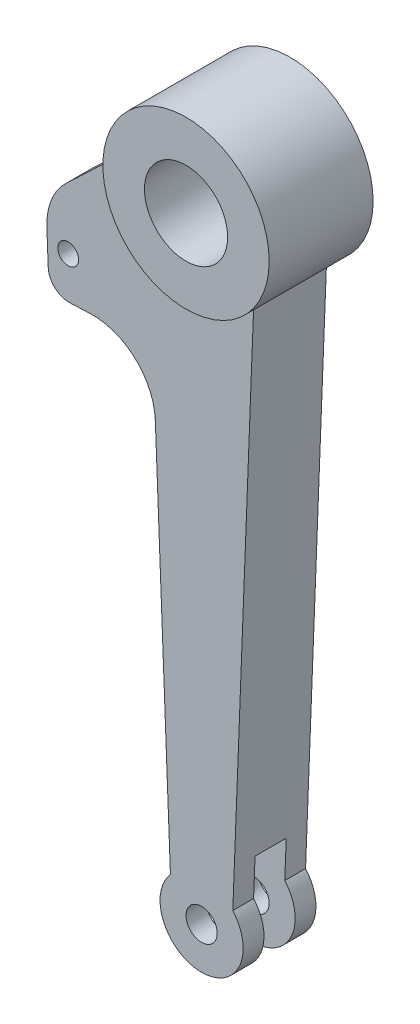
ISO-10303-21;
HEADER;
FILE_DESCRIPTION(('STEP AP214'),'2;1');
FILE_NAME('part.step','',(''),(''),'','','');
FILE_SCHEMA(('AUTOMOTIVE_DESIGN { 1 0 10303 214 1 1 1 1 }'));
ENDSEC;
DATA;
#1=APPLICATION_CONTEXT('core data for automotive mechanical design processes');
#2=APPLICATION_PROTOCOL_DEFINITION('international standard','automotive_design',2000,#1);
#3=PRODUCT_CONTEXT('',#1,'mechanical');
#4=PRODUCT('Part','Part','',(#3));
#5=PRODUCT_RELATED_PRODUCT_CATEGORY('part','',(#4));
#6=PRODUCT_DEFINITION_FORMATION('','',#4);
#7=PRODUCT_DEFINITION_CONTEXT('part definition',#1,'design');
#8=PRODUCT_DEFINITION('design','',#6,#7);
#9=PRODUCT_DEFINITION_SHAPE('','',#8);
#10=(LENGTH_UNIT() NAMED_UNIT(*) SI_UNIT(.MILLI.,.METRE.));
#11=(NAMED_UNIT(*) PLANE_ANGLE_UNIT() SI_UNIT($,.RADIAN.));
#12=(NAMED_UNIT(*) SI_UNIT($,.STERADIAN.) SOLID_ANGLE_UNIT());
#13=UNCERTAINTY_MEASURE_WITH_UNIT(LENGTH_MEASURE(1.E-05),#10,'distance_accuracy_value','');
#14=(GEOMETRIC_REPRESENTATION_CONTEXT(3) GLOBAL_UNCERTAINTY_ASSIGNED_CONTEXT((#13)) GLOBAL_UNIT_ASSIGNED_CONTEXT((#10,
#11,#12)) REPRESENTATION_CONTEXT('',''));
#15=CARTESIAN_POINT('',(0.,0.,0.));
#16=DIRECTION('',(0.,0.,1.));
#17=DIRECTION('',(1.,0.,0.));
#18=AXIS2_PLACEMENT_3D('',#15,#16,#17);
#19=CARTESIAN_POINT('',(-25.,-31.224989991992,17.5));
#20=DIRECTION('',(0.999235227011224,0.0391019321751174,0.));
#21=DIRECTION('',(-0.0391019321751174,0.999235227011224,0.));
#22=AXIS2_PLACEMENT_3D('',#19,#20,#21);
#23=PLANE('',#22);
#24=DIRECTION('',(0.0391019321751174,-0.999235227011224,0.));
#25=VECTOR('',#24,1.);
#26=CARTESIAN_POINT('',(-25.,-31.224989991992,17.5));
#27=LINE('',#26,#25);
#28=CARTESIAN_POINT('',(-22.2628647477418,-101.171455882778,17.5));
#29=VERTEX_POINT('',#28);
#30=CARTESIAN_POINT('',(-15.,-286.771243444677,17.5));
#31=VERTEX_POINT('',#30);
#32=EDGE_CURVE('E393',#29,#31,#27,.T.);
#33=ORIENTED_EDGE('',*,*,#32,.F.);
#34=DIRECTION('',(0.,0.,1.));
#35=VECTOR('',#34,1.);
#36=CARTESIAN_POINT('',(-22.2628647477418,-101.171455882778,5.));
#37=LINE('',#36,#35);
#38=CARTESIAN_POINT('',(-22.2628647477418,-101.171455882778,5.));
#39=VERTEX_POINT('',#38);
#40=EDGE_CURVE('E214',#29,#39,#37,.F.);
#41=ORIENTED_EDGE('',*,*,#40,.T.);
#42=DIRECTION('',(0.0391019321751174,-0.999235227011224,0.));
#43=VECTOR('',#42,1.);
#44=CARTESIAN_POINT('',(-26.1817996580687,-1.02454249687978,5.));
#45=LINE('',#44,#43);
#46=CARTESIAN_POINT('',(-25.,-31.224989991992,5.));
#47=VERTEX_POINT('',#46);
#48=EDGE_CURVE('E197',#47,#39,#45,.T.);
#49=ORIENTED_EDGE('',*,*,#48,.F.);
#50=DIRECTION('',(0.,0.,-1.));
#51=VECTOR('',#50,1.);
#52=CARTESIAN_POINT('',(-25.,-31.224989991992,17.5));
#53=LINE('',#52,#51);
#54=CARTESIAN_POINT('',(-25.,-31.224989991992,-5.));
#55=VERTEX_POINT('',#54);
#56=EDGE_CURVE('E211',#47,#55,#53,.T.);
#57=ORIENTED_EDGE('',*,*,#56,.T.);
#58=DIRECTION('',(0.0391019321751174,-0.999235227011224,0.));
#59=VECTOR('',#58,1.);
#60=CARTESIAN_POINT('',(-26.1817996580687,-1.02454249687978,-5.00000000000001));
#61=LINE('',#60,#59);
#62=CARTESIAN_POINT('',(-22.2628647477418,-101.171455882778,-4.99999999999999));
#63=VERTEX_POINT('',#62);
#64=EDGE_CURVE('E346',#55,#63,#61,.T.);
#65=ORIENTED_EDGE('',*,*,#64,.T.);
#66=DIRECTION('',(0.,0.,1.));
#67=VECTOR('',#66,1.);
#68=CARTESIAN_POINT('',(-22.2628647477418,-101.171455882778,-17.5));
#69=LINE('',#68,#67);
#70=CARTESIAN_POINT('',(-22.2628647477418,-101.171455882778,-17.5));
#71=VERTEX_POINT('',#70);
#72=EDGE_CURVE('E282',#63,#71,#69,.F.);
#73=ORIENTED_EDGE('',*,*,#72,.T.);
#74=DIRECTION('',(0.0391019321751174,-0.999235227011224,0.));
#75=VECTOR('',#74,1.);
#76=CARTESIAN_POINT('',(-25.,-31.224989991992,-17.5));
#77=LINE('',#76,#75);
#78=CARTESIAN_POINT('',(-15.,-286.771243444677,-17.5));
#79=VERTEX_POINT('',#78);
#80=EDGE_CURVE('E403',#71,#79,#77,.T.);
#81=ORIENTED_EDGE('',*,*,#80,.T.);
#82=DIRECTION('',(0.,0.,-1.));
#83=VECTOR('',#82,1.);
#84=CARTESIAN_POINT('',(-15.,-286.771243444677,17.5));
#85=LINE('',#84,#83);
#86=CARTESIAN_POINT('',(-15.,-286.771243444677,-7.5));
#87=VERTEX_POINT('',#86);
#88=EDGE_CURVE('E229',#87,#79,#85,.T.);
#89=ORIENTED_EDGE('',*,*,#88,.F.);
#90=DIRECTION('',(0.0391019321751174,-0.999235227011224,0.));
#91=VECTOR('',#90,1.);
#92=CARTESIAN_POINT('',(-25.,-31.224989991992,-7.5));
#93=LINE('',#92,#91);
#94=CARTESIAN_POINT('',(-15.7062997421266,-268.722018153172,-7.5));
#95=VERTEX_POINT('',#94);
#96=EDGE_CURVE('E379',#95,#87,#93,.T.);
#97=ORIENTED_EDGE('',*,*,#96,.F.);
#98=DIRECTION('',(0.,0.,1.));
#99=VECTOR('',#98,1.);
#100=CARTESIAN_POINT('',(-15.7062997421266,-268.722018153172,-7.5));
#101=LINE('',#100,#99);
#102=CARTESIAN_POINT('',(-15.7062997421266,-268.722018153172,7.5));
#103=VERTEX_POINT('',#102);
#104=EDGE_CURVE('E381',#95,#103,#101,.T.);
#105=ORIENTED_EDGE('',*,*,#104,.T.);
#106=DIRECTION('',(0.0391019321751174,-0.999235227011224,0.));
#107=VECTOR('',#106,1.);
#108=CARTESIAN_POINT('',(-25.,-31.224989991992,7.5));
#109=LINE('',#108,#107);
#110=CARTESIAN_POINT('',(-15.,-286.771243444677,7.5));
#111=VERTEX_POINT('',#110);
#112=EDGE_CURVE('E251',#103,#111,#109,.T.);
#113=ORIENTED_EDGE('',*,*,#112,.T.);
#114=EDGE_CURVE('E223',#31,#111,#85,.T.);
#115=ORIENTED_EDGE('',*,*,#114,.F.);
#116=EDGE_LOOP('',(#33,#41,#49,#57,#65,#73,#81,#89,#97,#105,#113,#115));
#117=FACE_BOUND('',#116,.T.);
#118=ADVANCED_FACE('F35',(#117),#23,.F.);
#119=CARTESIAN_POINT('',(0.,-300.,17.5));
#120=DIRECTION('',(0.,0.,-1.));
#121=DIRECTION('',(-1.,0.,0.));
#122=AXIS2_PLACEMENT_3D('',#119,#120,#121);
#123=CYLINDRICAL_SURFACE('',#122,20.);
#124=CARTESIAN_POINT('',(0.,-300.,-7.5));
#125=DIRECTION('',(0.,0.,1.));
#126=DIRECTION('',(1.,0.,0.));
#127=AXIS2_PLACEMENT_3D('',#124,#125,#126);
#128=CIRCLE('',#127,20.);
#129=CARTESIAN_POINT('',(15.,-286.771243444677,-7.5));
#130=VERTEX_POINT('',#129);
#131=EDGE_CURVE('E377',#87,#130,#128,.T.);
#132=ORIENTED_EDGE('',*,*,#131,.F.);
#133=ORIENTED_EDGE('',*,*,#88,.T.);
#134=CARTESIAN_POINT('',(0.,-300.,-17.5));
#135=DIRECTION('',(0.,0.,1.));
#136=DIRECTION('',(1.,0.,0.));
#137=AXIS2_PLACEMENT_3D('',#134,#135,#136);
#138=CIRCLE('',#137,20.);
#139=CARTESIAN_POINT('',(15.,-286.771243444677,-17.5));
#140=VERTEX_POINT('',#139);
#141=EDGE_CURVE('E405',#79,#140,#138,.T.);
#142=ORIENTED_EDGE('',*,*,#141,.T.);
#143=DIRECTION('',(0.,0.,-1.));
#144=VECTOR('',#143,1.);
#145=CARTESIAN_POINT('',(15.,-286.771243444677,17.5));
#146=LINE('',#145,#144);
#147=EDGE_CURVE('E410',#130,#140,#146,.T.);
#148=ORIENTED_EDGE('',*,*,#147,.F.);
#149=EDGE_LOOP('',(#132,#133,#142,#148));
#150=FACE_BOUND('',#149,.T.);
#151=ADVANCED_FACE('F426',(#150),#123,.T.);
#152=CARTESIAN_POINT('',(15.,-286.771243444677,17.5));
#153=DIRECTION('',(-0.999235227011224,0.0391019321751174,0.));
#154=DIRECTION('',(-0.0391019321751174,-0.999235227011224,0.));
#155=AXIS2_PLACEMENT_3D('',#152,#153,#154);
#156=PLANE('',#155);
#157=DIRECTION('',(0.0391019321751174,0.999235227011224,0.));
#158=VECTOR('',#157,1.);
#159=CARTESIAN_POINT('',(15.,-286.771243444677,-7.5));
#160=LINE('',#159,#158);
#161=CARTESIAN_POINT('',(15.7062997421266,-268.722018153172,-7.5));
#162=VERTEX_POINT('',#161);
#163=EDGE_CURVE('E250',#130,#162,#160,.T.);
#164=ORIENTED_EDGE('',*,*,#163,.F.);
#165=ORIENTED_EDGE('',*,*,#147,.T.);
#166=DIRECTION('',(0.0391019321751174,0.999235227011224,0.));
#167=VECTOR('',#166,1.);
#168=CARTESIAN_POINT('',(15.,-286.771243444677,-17.5));
#169=LINE('',#168,#167);
#170=CARTESIAN_POINT('',(25.,-31.224989991992,-17.5));
#171=VERTEX_POINT('',#170);
#172=EDGE_CURVE('E394',#140,#171,#169,.T.);
#173=ORIENTED_EDGE('',*,*,#172,.T.);
#174=DIRECTION('',(0.,0.,-1.));
#175=VECTOR('',#174,1.);
#176=CARTESIAN_POINT('',(25.,-31.224989991992,17.5));
#177=LINE('',#176,#175);
#178=CARTESIAN_POINT('',(25.,-31.224989991992,17.5));
#179=VERTEX_POINT('',#178);
#180=EDGE_CURVE('E401',#179,#171,#177,.T.);
#181=ORIENTED_EDGE('',*,*,#180,.F.);
#182=DIRECTION('',(0.0391019321751174,0.999235227011224,0.));
#183=VECTOR('',#182,1.);
#184=CARTESIAN_POINT('',(15.,-286.771243444677,17.5));
#185=LINE('',#184,#183);
#186=CARTESIAN_POINT('',(15.,-286.771243444677,17.5));
#187=VERTEX_POINT('',#186);
#188=EDGE_CURVE('E398',#187,#179,#185,.T.);
#189=ORIENTED_EDGE('',*,*,#188,.F.);
#190=CARTESIAN_POINT('',(15.,-286.771243444677,7.5));
#191=VERTEX_POINT('',#190);
#192=EDGE_CURVE('E411',#187,#191,#146,.T.);
#193=ORIENTED_EDGE('',*,*,#192,.T.);
#194=DIRECTION('',(0.0391019321751174,0.999235227011224,0.));
#195=VECTOR('',#194,1.);
#196=CARTESIAN_POINT('',(15.,-286.771243444677,7.5));
#197=LINE('',#196,#195);
#198=CARTESIAN_POINT('',(15.7062997421266,-268.722018153172,7.5));
#199=VERTEX_POINT('',#198);
#200=EDGE_CURVE('E245',#191,#199,#197,.T.);
#201=ORIENTED_EDGE('',*,*,#200,.T.);
#202=DIRECTION('',(0.,0.,1.));
#203=VECTOR('',#202,1.);
#204=CARTESIAN_POINT('',(15.7062997421266,-268.722018153172,-7.5));
#205=LINE('',#204,#203);
#206=EDGE_CURVE('E239',#199,#162,#205,.F.);
#207=ORIENTED_EDGE('',*,*,#206,.T.);
#208=EDGE_LOOP('',(#164,#165,#173,#181,#189,#193,#201,#207));
#209=FACE_BOUND('',#208,.T.);
#210=ADVANCED_FACE('F419',(#209),#156,.F.);
#211=CARTESIAN_POINT('',(0.,-300.,17.5));
#212=DIRECTION('',(0.,0.,-1.));
#213=DIRECTION('',(-1.,0.,0.));
#214=AXIS2_PLACEMENT_3D('',#211,#212,#213);
#215=CYLINDRICAL_SURFACE('',#214,7.50000000000001);
#216=CARTESIAN_POINT('',(0.,-300.,-17.5));
#217=DIRECTION('',(0.,0.,1.));
#218=DIRECTION('',(1.,0.,0.));
#219=AXIS2_PLACEMENT_3D('',#216,#217,#218);
#220=CIRCLE('',#219,7.50000000000001);
#221=CARTESIAN_POINT('',(7.50000000000001,-300.,-17.5));
#222=VERTEX_POINT('',#221);
#223=EDGE_CURVE('E384',#222,#222,#220,.T.);
#224=ORIENTED_EDGE('',*,*,#223,.F.);
#225=EDGE_LOOP('',(#224));
#226=FACE_BOUND('',#225,.T.);
#227=CARTESIAN_POINT('',(0.,-300.,-7.5));
#228=DIRECTION('',(0.,0.,1.));
#229=DIRECTION('',(1.,0.,0.));
#230=AXIS2_PLACEMENT_3D('',#227,#228,#229);
#231=CIRCLE('',#230,7.50000000000001);
#232=CARTESIAN_POINT('',(7.50000000000001,-300.,-7.5));
#233=VERTEX_POINT('',#232);
#234=EDGE_CURVE('E247',#233,#233,#231,.T.);
#235=ORIENTED_EDGE('',*,*,#234,.T.);
#236=EDGE_LOOP('',(#235));
#237=FACE_BOUND('',#236,.T.);
#238=ADVANCED_FACE('F499',(#226,#237),#215,.F.);
#239=CARTESIAN_POINT('',(0.,0.,25.));
#240=DIRECTION('',(0.,0.,-1.));
#241=DIRECTION('',(-1.,0.,0.));
#242=AXIS2_PLACEMENT_3D('',#239,#240,#241);
#243=CYLINDRICAL_SURFACE('',#242,40.);
#244=CARTESIAN_POINT('',(0.,0.,-25.));
#245=DIRECTION('',(0.,0.,1.));
#246=DIRECTION('',(1.,0.,0.));
#247=AXIS2_PLACEMENT_3D('',#244,#245,#246);
#248=CIRCLE('',#247,40.);
#249=CARTESIAN_POINT('',(40.,0.,-25.));
#250=VERTEX_POINT('',#249);
#251=EDGE_CURVE('E234',#250,#250,#248,.T.);
#252=ORIENTED_EDGE('',*,*,#251,.T.);
#253=EDGE_LOOP('',(#252));
#254=FACE_BOUND('',#253,.T.);
#255=CARTESIAN_POINT('',(0.,0.,25.));
#256=DIRECTION('',(0.,0.,1.));
#257=DIRECTION('',(1.,0.,0.));
#258=AXIS2_PLACEMENT_3D('',#255,#256,#257);
#259=CIRCLE('',#258,40.);
#260=CARTESIAN_POINT('',(40.,0.,25.));
#261=VERTEX_POINT('',#260);
#262=EDGE_CURVE('E236',#261,#261,#259,.T.);
#263=ORIENTED_EDGE('',*,*,#262,.F.);
#264=EDGE_LOOP('',(#263));
#265=FACE_BOUND('',#264,.T.);
#266=DIRECTION('',(0.,0.,-1.));
#267=VECTOR('',#266,1.);
#268=CARTESIAN_POINT('',(-39.8385645997927,3.59009340103295,25.));
#269=LINE('',#268,#267);
#270=CARTESIAN_POINT('',(-39.8385645997927,3.59009340103295,5.));
#271=VERTEX_POINT('',#270);
#272=CARTESIAN_POINT('',(-39.8385645997927,3.59009340103295,17.5));
#273=VERTEX_POINT('',#272);
#274=EDGE_CURVE('E299',#271,#273,#269,.F.);
#275=ORIENTED_EDGE('',*,*,#274,.T.);
#276=CARTESIAN_POINT('',(0.,0.,17.5));
#277=DIRECTION('',(0.,0.,-1.));
#278=DIRECTION('',(1.,0.,0.));
#279=AXIS2_PLACEMENT_3D('',#276,#277,#278);
#280=CIRCLE('',#279,40.);
#281=EDGE_CURVE('E391',#179,#273,#280,.T.);
#282=ORIENTED_EDGE('',*,*,#281,.F.);
#283=ORIENTED_EDGE('',*,*,#180,.T.);
#284=CARTESIAN_POINT('',(0.,0.,-17.5));
#285=DIRECTION('',(0.,0.,-1.));
#286=DIRECTION('',(1.,0.,0.));
#287=AXIS2_PLACEMENT_3D('',#284,#285,#286);
#288=CIRCLE('',#287,40.);
#289=CARTESIAN_POINT('',(-39.8385645997927,3.59009340103295,-17.5));
#290=VERTEX_POINT('',#289);
#291=EDGE_CURVE('E388',#171,#290,#288,.T.);
#292=ORIENTED_EDGE('',*,*,#291,.T.);
#293=DIRECTION('',(0.,0.,-1.));
#294=VECTOR('',#293,1.);
#295=CARTESIAN_POINT('',(-39.8385645997927,3.59009340103295,25.));
#296=LINE('',#295,#294);
#297=CARTESIAN_POINT('',(-39.8385645997927,3.59009340103295,-5.));
#298=VERTEX_POINT('',#297);
#299=EDGE_CURVE('E297',#290,#298,#296,.F.);
#300=ORIENTED_EDGE('',*,*,#299,.T.);
#301=CARTESIAN_POINT('',(0.,0.,-5.));
#302=DIRECTION('',(0.,0.,1.));
#303=DIRECTION('',(1.,0.,0.));
#304=AXIS2_PLACEMENT_3D('',#301,#302,#303);
#305=CIRCLE('',#304,40.);
#306=EDGE_CURVE('E221',#298,#55,#305,.T.);
#307=ORIENTED_EDGE('',*,*,#306,.T.);
#308=ORIENTED_EDGE('',*,*,#56,.F.);
#309=CARTESIAN_POINT('',(0.,0.,5.));
#310=DIRECTION('',(0.,0.,1.));
#311=DIRECTION('',(1.,0.,0.));
#312=AXIS2_PLACEMENT_3D('',#309,#310,#311);
#313=CIRCLE('',#312,40.);
#314=EDGE_CURVE('E193',#271,#47,#313,.T.);
#315=ORIENTED_EDGE('',*,*,#314,.F.);
#316=EDGE_LOOP('',(#275,#282,#283,#292,#300,#307,#308,#315));
#317=FACE_BOUND('',#316,.T.);
#318=ADVANCED_FACE('F219',(#254,#265,#317),#243,.T.);
#319=CARTESIAN_POINT('',(0.,0.,25.));
#320=DIRECTION('',(0.,0.,1.));
#321=DIRECTION('',(1.,0.,0.));
#322=AXIS2_PLACEMENT_3D('',#319,#320,#321);
#323=PLANE('',#322);
#324=ORIENTED_EDGE('',*,*,#262,.T.);
#325=EDGE_LOOP('',(#324));
#326=FACE_BOUND('',#325,.T.);
#327=CARTESIAN_POINT('',(0.,0.,25.));
#328=DIRECTION('',(0.,0.,1.));
#329=DIRECTION('',(1.,0.,0.));
#330=AXIS2_PLACEMENT_3D('',#327,#328,#329);
#331=CIRCLE('',#330,20.);
#332=CARTESIAN_POINT('',(20.,0.,25.));
#333=VERTEX_POINT('',#332);
#334=EDGE_CURVE('E226',#333,#333,#331,.T.);
#335=ORIENTED_EDGE('',*,*,#334,.F.);
#336=EDGE_LOOP('',(#335));
#337=FACE_BOUND('',#336,.T.);
#338=ADVANCED_FACE('F492',(#326,#337),#323,.T.);
#339=CARTESIAN_POINT('',(0.,0.,-25.));
#340=DIRECTION('',(0.,0.,1.));
#341=DIRECTION('',(1.,0.,0.));
#342=AXIS2_PLACEMENT_3D('',#339,#340,#341);
#343=PLANE('',#342);
#344=ORIENTED_EDGE('',*,*,#251,.F.);
#345=EDGE_LOOP('',(#344));
#346=FACE_BOUND('',#345,.T.);
#347=CARTESIAN_POINT('',(0.,0.,-25.));
#348=DIRECTION('',(0.,0.,1.));
#349=DIRECTION('',(1.,0.,0.));
#350=AXIS2_PLACEMENT_3D('',#347,#348,#349);
#351=CIRCLE('',#350,20.);
#352=CARTESIAN_POINT('',(20.,0.,-25.));
#353=VERTEX_POINT('',#352);
#354=EDGE_CURVE('E222',#353,#353,#351,.T.);
#355=ORIENTED_EDGE('',*,*,#354,.T.);
#356=EDGE_LOOP('',(#355));
#357=FACE_BOUND('',#356,.T.);
#358=ADVANCED_FACE('F490',(#346,#357),#343,.F.);
#359=CARTESIAN_POINT('',(0.,0.,25.));
#360=DIRECTION('',(0.,0.,-1.));
#361=DIRECTION('',(-1.,0.,0.));
#362=AXIS2_PLACEMENT_3D('',#359,#360,#361);
#363=CYLINDRICAL_SURFACE('',#362,20.);
#364=ORIENTED_EDGE('',*,*,#334,.T.);
#365=EDGE_LOOP('',(#364));
#366=FACE_BOUND('',#365,.T.);
#367=ORIENTED_EDGE('',*,*,#354,.F.);
#368=EDGE_LOOP('',(#367));
#369=FACE_BOUND('',#368,.T.);
#370=ADVANCED_FACE('F487',(#366,#369),#363,.F.);
#371=CARTESIAN_POINT('',(0.,0.,17.5));
#372=DIRECTION('',(0.,0.,1.));
#373=DIRECTION('',(1.,0.,0.));
#374=AXIS2_PLACEMENT_3D('',#371,#372,#373);
#375=PLANE('',#374);
#376=CARTESIAN_POINT('',(-64.1873704369466,-52.7737718192212,17.5));
#377=DIRECTION('',(0.,0.,1.));
#378=DIRECTION('',(1.,0.,0.));
#379=AXIS2_PLACEMENT_3D('',#376,#377,#378);
#380=CIRCLE('',#379,4.99999999999999);
#381=CARTESIAN_POINT('',(-59.1873704369467,-52.7737718192212,17.5));
#382=VERTEX_POINT('',#381);
#383=EDGE_CURVE('E350',#382,#382,#380,.T.);
#384=ORIENTED_EDGE('',*,*,#383,.F.);
#385=EDGE_LOOP('',(#384));
#386=FACE_BOUND('',#385,.T.);
#387=DIRECTION('',(0.725347292595793,0.688383109266892,0.));
#388=VECTOR('',#387,1.);
#389=CARTESIAN_POINT('',(-74.9617613505612,-33.1800866007479,17.5));
#390=LINE('',#389,#388);
#391=CARTESIAN_POINT('',(-65.1048316717084,-23.8254726531709,17.5));
#392=VERTEX_POINT('',#391);
#393=CARTESIAN_POINT('',(-42.914374657072,-2.76585617466675,17.5));
#394=VERTEX_POINT('',#393);
#395=EDGE_CURVE('E206',#392,#394,#390,.T.);
#396=ORIENTED_EDGE('',*,*,#395,.F.);
#397=CARTESIAN_POINT('',(-44.4533383937017,-45.5858914310446,17.5));
#398=DIRECTION('',(0.,0.,1.));
#399=DIRECTION('',(1.,0.,0.));
#400=AXIS2_PLACEMENT_3D('',#397,#398,#399);
#401=CIRCLE('',#400,30.);
#402=CARTESIAN_POINT('',(-74.4303952040384,-46.7589493962982,17.5));
#403=VERTEX_POINT('',#402);
#404=EDGE_CURVE('E324',#392,#403,#401,.T.);
#405=ORIENTED_EDGE('',*,*,#404,.T.);
#406=DIRECTION('',(-0.0391019321751174,0.999235227011224,0.));
#407=VECTOR('',#406,1.);
#408=CARTESIAN_POINT('',(-76.1435610086299,-2.97963910563565,17.5));
#409=LINE('',#408,#407);
#410=CARTESIAN_POINT('',(-73.7887033853077,-63.1571434110846,17.5));
#411=VERTEX_POINT('',#410);
#412=EDGE_CURVE('E355',#411,#403,#409,.T.);
#413=ORIENTED_EDGE('',*,*,#412,.F.);
#414=CARTESIAN_POINT('',(-63.7963511151954,-62.7661240893334,17.5));
#415=DIRECTION('',(0.,0.,1.));
#416=DIRECTION('',(1.,0.,0.));
#417=AXIS2_PLACEMENT_3D('',#414,#415,#416);
#418=CIRCLE('',#417,10.);
#419=CARTESIAN_POINT('',(-63.4053317934443,-72.7584763594457,17.5));
#420=VERTEX_POINT('',#419);
#421=EDGE_CURVE('E272',#411,#420,#418,.T.);
#422=ORIENTED_EDGE('',*,*,#421,.T.);
#423=DIRECTION('',(0.999235227011224,0.0391019321751174,0.));
#424=VECTOR('',#423,1.);
#425=CARTESIAN_POINT('',(-73.3976840635565,-73.1494956811968,17.5));
#426=LINE('',#425,#424);
#427=CARTESIAN_POINT('',(-53.412979523332,-72.3674570376945,17.5));
#428=VERTEX_POINT('',#427);
#429=EDGE_CURVE('E357',#420,#428,#426,.T.);
#430=ORIENTED_EDGE('',*,*,#429,.T.);
#431=CARTESIAN_POINT('',(-52.2399215580785,-102.344513848031,17.5));
#432=DIRECTION('',(0.,0.,1.));
#433=DIRECTION('',(1.,0.,0.));
#434=AXIS2_PLACEMENT_3D('',#431,#432,#433);
#435=CIRCLE('',#434,30.);
#436=EDGE_CURVE('E288',#428,#29,#435,.F.);
#437=ORIENTED_EDGE('',*,*,#436,.T.);
#438=ORIENTED_EDGE('',*,*,#32,.T.);
#439=CARTESIAN_POINT('',(0.,-300.,17.5));
#440=DIRECTION('',(0.,0.,1.));
#441=DIRECTION('',(1.,0.,0.));
#442=AXIS2_PLACEMENT_3D('',#439,#440,#441);
#443=CIRCLE('',#442,20.);
#444=EDGE_CURVE('E396',#31,#187,#443,.T.);
#445=ORIENTED_EDGE('',*,*,#444,.T.);
#446=ORIENTED_EDGE('',*,*,#188,.T.);
#447=ORIENTED_EDGE('',*,*,#281,.T.);
#448=CARTESIAN_POINT('',(-49.7982057497409,4.48761675129118,17.5));
#449=DIRECTION('',(0.,0.,1.));
#450=DIRECTION('',(1.,0.,0.));
#451=AXIS2_PLACEMENT_3D('',#448,#449,#450);
#452=CIRCLE('',#451,10.);
#453=EDGE_CURVE('E307',#273,#394,#452,.F.);
#454=ORIENTED_EDGE('',*,*,#453,.T.);
#455=EDGE_LOOP('',(#396,#405,#413,#422,#430,#437,#438,#445,#446,#447,#454));
#456=FACE_BOUND('',#455,.T.);
#457=CARTESIAN_POINT('',(0.,-300.,17.5));
#458=DIRECTION('',(0.,0.,1.));
#459=DIRECTION('',(1.,0.,0.));
#460=AXIS2_PLACEMENT_3D('',#457,#458,#459);
#461=CIRCLE('',#460,7.50000000000001);
#462=CARTESIAN_POINT('',(7.50000000000001,-300.,17.5));
#463=VERTEX_POINT('',#462);
#464=EDGE_CURVE('E385',#463,#463,#461,.T.);
#465=ORIENTED_EDGE('',*,*,#464,.F.);
#466=EDGE_LOOP('',(#465));
#467=FACE_BOUND('',#466,.T.);
#468=ADVANCED_FACE('F434',(#386,#456,#467),#375,.T.);
#469=CARTESIAN_POINT('',(0.,0.,-17.5));
#470=DIRECTION('',(0.,0.,1.));
#471=DIRECTION('',(1.,0.,0.));
#472=AXIS2_PLACEMENT_3D('',#469,#470,#471);
#473=PLANE('',#472);
#474=CARTESIAN_POINT('',(-64.1873704369466,-52.7737718192212,-17.5));
#475=DIRECTION('',(0.,0.,-1.));
#476=DIRECTION('',(-1.,0.,0.));
#477=AXIS2_PLACEMENT_3D('',#474,#475,#476);
#478=CIRCLE('',#477,4.99999999999999);
#479=CARTESIAN_POINT('',(-69.1873704369466,-52.7737718192212,-17.5));
#480=VERTEX_POINT('',#479);
#481=EDGE_CURVE('E259',#480,#480,#478,.T.);
#482=ORIENTED_EDGE('',*,*,#481,.F.);
#483=EDGE_LOOP('',(#482));
#484=FACE_BOUND('',#483,.T.);
#485=DIRECTION('',(0.0391019321751174,-0.999235227011224,0.));
#486=VECTOR('',#485,1.);
#487=CARTESIAN_POINT('',(-76.1435610086299,-2.97963910563565,-17.5));
#488=LINE('',#487,#486);
#489=CARTESIAN_POINT('',(-74.4303952040384,-46.7589493962982,-17.5));
#490=VERTEX_POINT('',#489);
#491=CARTESIAN_POINT('',(-73.7887033853077,-63.1571434110846,-17.5));
#492=VERTEX_POINT('',#491);
#493=EDGE_CURVE('E333',#490,#492,#488,.T.);
#494=ORIENTED_EDGE('',*,*,#493,.F.);
#495=CARTESIAN_POINT('',(-44.4533383937017,-45.5858914310446,-17.5));
#496=DIRECTION('',(0.,0.,1.));
#497=DIRECTION('',(1.,0.,0.));
#498=AXIS2_PLACEMENT_3D('',#495,#496,#497);
#499=CIRCLE('',#498,30.);
#500=CARTESIAN_POINT('',(-65.1048316717084,-23.8254726531709,-17.5));
#501=VERTEX_POINT('',#500);
#502=EDGE_CURVE('E57',#490,#501,#499,.F.);
#503=ORIENTED_EDGE('',*,*,#502,.T.);
#504=DIRECTION('',(0.725347292595793,0.688383109266892,0.));
#505=VECTOR('',#504,1.);
#506=CARTESIAN_POINT('',(-74.9617613505612,-33.1800866007479,-17.5));
#507=LINE('',#506,#505);
#508=CARTESIAN_POINT('',(-42.914374657072,-2.76585617466675,-17.5));
#509=VERTEX_POINT('',#508);
#510=EDGE_CURVE('E546',#501,#509,#507,.T.);
#511=ORIENTED_EDGE('',*,*,#510,.T.);
#512=CARTESIAN_POINT('',(-49.7982057497409,4.48761675129118,-17.5));
#513=DIRECTION('',(0.,0.,1.));
#514=DIRECTION('',(1.,0.,0.));
#515=AXIS2_PLACEMENT_3D('',#512,#513,#514);
#516=CIRCLE('',#515,10.);
#517=EDGE_CURVE('E311',#509,#290,#516,.T.);
#518=ORIENTED_EDGE('',*,*,#517,.T.);
#519=ORIENTED_EDGE('',*,*,#291,.F.);
#520=ORIENTED_EDGE('',*,*,#172,.F.);
#521=ORIENTED_EDGE('',*,*,#141,.F.);
#522=ORIENTED_EDGE('',*,*,#80,.F.);
#523=CARTESIAN_POINT('',(-52.2399215580785,-102.344513848031,-17.5));
#524=DIRECTION('',(0.,0.,1.));
#525=DIRECTION('',(1.,0.,0.));
#526=AXIS2_PLACEMENT_3D('',#523,#524,#525);
#527=CIRCLE('',#526,30.);
#528=CARTESIAN_POINT('',(-53.412979523332,-72.3674570376945,-17.5));
#529=VERTEX_POINT('',#528);
#530=EDGE_CURVE('E295',#71,#529,#527,.T.);
#531=ORIENTED_EDGE('',*,*,#530,.T.);
#532=DIRECTION('',(0.999235227011224,0.0391019321751174,0.));
#533=VECTOR('',#532,1.);
#534=CARTESIAN_POINT('',(-73.3976840635565,-73.1494956811968,-17.5));
#535=LINE('',#534,#533);
#536=CARTESIAN_POINT('',(-63.4053317934443,-72.7584763594457,-17.5));
#537=VERTEX_POINT('',#536);
#538=EDGE_CURVE('E217',#537,#529,#535,.T.);
#539=ORIENTED_EDGE('',*,*,#538,.F.);
#540=CARTESIAN_POINT('',(-63.7963511151954,-62.7661240893334,-17.5));
#541=DIRECTION('',(0.,0.,1.));
#542=DIRECTION('',(1.,0.,0.));
#543=AXIS2_PLACEMENT_3D('',#540,#541,#542);
#544=CIRCLE('',#543,10.);
#545=EDGE_CURVE('E266',#537,#492,#544,.F.);
#546=ORIENTED_EDGE('',*,*,#545,.T.);
#547=EDGE_LOOP('',(#494,#503,#511,#518,#519,#520,#521,#522,#531,#539,#546));
#548=FACE_BOUND('',#547,.T.);
#549=ORIENTED_EDGE('',*,*,#223,.T.);
#550=EDGE_LOOP('',(#549));
#551=FACE_BOUND('',#550,.T.);
#552=ADVANCED_FACE('F337',(#484,#548,#551),#473,.F.);
#553=ORIENTED_EDGE('',*,*,#114,.T.);
#554=CARTESIAN_POINT('',(0.,-300.,7.5));
#555=DIRECTION('',(0.,0.,1.));
#556=DIRECTION('',(1.,0.,0.));
#557=AXIS2_PLACEMENT_3D('',#554,#555,#556);
#558=CIRCLE('',#557,20.);
#559=EDGE_CURVE('E371',#111,#191,#558,.T.);
#560=ORIENTED_EDGE('',*,*,#559,.T.);
#561=ORIENTED_EDGE('',*,*,#192,.F.);
#562=ORIENTED_EDGE('',*,*,#444,.F.);
#563=EDGE_LOOP('',(#553,#560,#561,#562));
#564=FACE_BOUND('',#563,.T.);
#565=ADVANCED_FACE('F440',(#564),#123,.T.);
#566=CARTESIAN_POINT('',(0.,-300.,7.5));
#567=DIRECTION('',(0.,0.,1.));
#568=DIRECTION('',(1.,0.,0.));
#569=AXIS2_PLACEMENT_3D('',#566,#567,#568);
#570=CIRCLE('',#569,7.50000000000001);
#571=CARTESIAN_POINT('',(7.50000000000001,-300.,7.5));
#572=VERTEX_POINT('',#571);
#573=EDGE_CURVE('E242',#572,#572,#570,.T.);
#574=ORIENTED_EDGE('',*,*,#573,.F.);
#575=EDGE_LOOP('',(#574));
#576=FACE_BOUND('',#575,.T.);
#577=ORIENTED_EDGE('',*,*,#464,.T.);
#578=EDGE_LOOP('',(#577));
#579=FACE_BOUND('',#578,.T.);
#580=ADVANCED_FACE('F506',(#576,#579),#215,.F.);
#581=CARTESIAN_POINT('',(0.,-300.,-7.5));
#582=DIRECTION('',(0.,0.,1.));
#583=DIRECTION('',(1.,0.,0.));
#584=AXIS2_PLACEMENT_3D('',#581,#582,#583);
#585=CYLINDRICAL_SURFACE('',#584,35.);
#586=CARTESIAN_POINT('',(0.,-300.,-7.5));
#587=DIRECTION('',(0.,0.,1.));
#588=DIRECTION('',(1.,0.,0.));
#589=AXIS2_PLACEMENT_3D('',#586,#587,#588);
#590=CIRCLE('',#589,35.);
#591=EDGE_CURVE('E246',#162,#95,#590,.T.);
#592=ORIENTED_EDGE('',*,*,#591,.F.);
#593=ORIENTED_EDGE('',*,*,#206,.F.);
#594=CARTESIAN_POINT('',(0.,-300.,7.5));
#595=DIRECTION('',(0.,0.,1.));
#596=DIRECTION('',(1.,0.,0.));
#597=AXIS2_PLACEMENT_3D('',#594,#595,#596);
#598=CIRCLE('',#597,35.);
#599=EDGE_CURVE('E364',#199,#103,#598,.T.);
#600=ORIENTED_EDGE('',*,*,#599,.T.);
#601=ORIENTED_EDGE('',*,*,#104,.F.);
#602=EDGE_LOOP('',(#592,#593,#600,#601));
#603=FACE_BOUND('',#602,.T.);
#604=ADVANCED_FACE('F446',(#603),#585,.F.);
#605=CARTESIAN_POINT('',(0.,-300.,-7.5));
#606=DIRECTION('',(0.,0.,1.));
#607=DIRECTION('',(1.,0.,0.));
#608=AXIS2_PLACEMENT_3D('',#605,#606,#607);
#609=PLANE('',#608);
#610=ORIENTED_EDGE('',*,*,#234,.F.);
#611=EDGE_LOOP('',(#610));
#612=FACE_BOUND('',#611,.T.);
#613=ORIENTED_EDGE('',*,*,#96,.T.);
#614=ORIENTED_EDGE('',*,*,#131,.T.);
#615=ORIENTED_EDGE('',*,*,#163,.T.);
#616=ORIENTED_EDGE('',*,*,#591,.T.);
#617=EDGE_LOOP('',(#613,#614,#615,#616));
#618=FACE_BOUND('',#617,.T.);
#619=ADVANCED_FACE('F449',(#612,#618),#609,.T.);
#620=CARTESIAN_POINT('',(0.,-300.,7.5));
#621=DIRECTION('',(0.,0.,1.));
#622=DIRECTION('',(1.,0.,0.));
#623=AXIS2_PLACEMENT_3D('',#620,#621,#622);
#624=PLANE('',#623);
#625=ORIENTED_EDGE('',*,*,#573,.T.);
#626=EDGE_LOOP('',(#625));
#627=FACE_BOUND('',#626,.T.);
#628=ORIENTED_EDGE('',*,*,#599,.F.);
#629=ORIENTED_EDGE('',*,*,#200,.F.);
#630=ORIENTED_EDGE('',*,*,#559,.F.);
#631=ORIENTED_EDGE('',*,*,#112,.F.);
#632=EDGE_LOOP('',(#628,#629,#630,#631));
#633=FACE_BOUND('',#632,.T.);
#634=ADVANCED_FACE('F442',(#627,#633),#624,.F.);
#635=CARTESIAN_POINT('',(-76.1435610086299,-2.97963910563565,5.));
#636=DIRECTION('',(0.,0.,1.));
#637=DIRECTION('',(0.,-1.,0.));
#638=AXIS2_PLACEMENT_3D('',#635,#636,#637);
#639=PLANE('',#638);
#640=CARTESIAN_POINT('',(-64.1873704369466,-52.7737718192212,5.));
#641=DIRECTION('',(0.,0.,1.));
#642=DIRECTION('',(0.,-1.,0.));
#643=AXIS2_PLACEMENT_3D('',#640,#641,#642);
#644=CIRCLE('',#643,4.99999999999999);
#645=CARTESIAN_POINT('',(-64.1873704369466,-57.7737718192212,5.));
#646=VERTEX_POINT('',#645);
#647=EDGE_CURVE('E258',#646,#646,#644,.T.);
#648=ORIENTED_EDGE('',*,*,#647,.T.);
#649=EDGE_LOOP('',(#648));
#650=FACE_BOUND('',#649,.T.);
#651=DIRECTION('',(0.0391019321751174,-0.999235227011224,0.));
#652=VECTOR('',#651,1.);
#653=CARTESIAN_POINT('',(-76.1435610086299,-2.97963910563565,5.));
#654=LINE('',#653,#652);
#655=CARTESIAN_POINT('',(-74.4303952040384,-46.7589493962982,5.));
#656=VERTEX_POINT('',#655);
#657=CARTESIAN_POINT('',(-73.7887033853077,-63.1571434110846,5.));
#658=VERTEX_POINT('',#657);
#659=EDGE_CURVE('E216',#656,#658,#654,.T.);
#660=ORIENTED_EDGE('',*,*,#659,.F.);
#661=CARTESIAN_POINT('',(-44.4533383937017,-45.5858914310446,5.));
#662=DIRECTION('',(0.,0.,1.));
#663=DIRECTION('',(0.,-1.,0.));
#664=AXIS2_PLACEMENT_3D('',#661,#662,#663);
#665=CIRCLE('',#664,30.);
#666=CARTESIAN_POINT('',(-65.1048316717084,-23.8254726531709,5.));
#667=VERTEX_POINT('',#666);
#668=EDGE_CURVE('E320',#656,#667,#665,.F.);
#669=ORIENTED_EDGE('',*,*,#668,.T.);
#670=DIRECTION('',(0.725347292595793,0.688383109266892,0.));
#671=VECTOR('',#670,1.);
#672=CARTESIAN_POINT('',(-74.9617613505612,-33.1800866007479,5.));
#673=LINE('',#672,#671);
#674=CARTESIAN_POINT('',(-42.914374657072,-2.76585617466675,5.));
#675=VERTEX_POINT('',#674);
#676=EDGE_CURVE('E205',#667,#675,#673,.T.);
#677=ORIENTED_EDGE('',*,*,#676,.T.);
#678=CARTESIAN_POINT('',(-49.7982057497409,4.48761675129118,5.));
#679=DIRECTION('',(0.,0.,1.));
#680=DIRECTION('',(0.,-1.,0.));
#681=AXIS2_PLACEMENT_3D('',#678,#679,#680);
#682=CIRCLE('',#681,10.);
#683=EDGE_CURVE('E200',#675,#271,#682,.T.);
#684=ORIENTED_EDGE('',*,*,#683,.T.);
#685=ORIENTED_EDGE('',*,*,#314,.T.);
#686=ORIENTED_EDGE('',*,*,#48,.T.);
#687=CARTESIAN_POINT('',(-52.2399215580785,-102.344513848031,5.));
#688=DIRECTION('',(0.,0.,1.));
#689=DIRECTION('',(0.,-1.,0.));
#690=AXIS2_PLACEMENT_3D('',#687,#688,#689);
#691=CIRCLE('',#690,30.);
#692=CARTESIAN_POINT('',(-53.412979523332,-72.3674570376945,5.));
#693=VERTEX_POINT('',#692);
#694=EDGE_CURVE('E290',#39,#693,#691,.T.);
#695=ORIENTED_EDGE('',*,*,#694,.T.);
#696=DIRECTION('',(0.999235227011224,0.0391019321751174,0.));
#697=VECTOR('',#696,1.);
#698=CARTESIAN_POINT('',(-73.3976840635565,-73.1494956811968,5.));
#699=LINE('',#698,#697);
#700=CARTESIAN_POINT('',(-63.4053317934443,-72.7584763594457,5.));
#701=VERTEX_POINT('',#700);
#702=EDGE_CURVE('E361',#701,#693,#699,.T.);
#703=ORIENTED_EDGE('',*,*,#702,.F.);
#704=CARTESIAN_POINT('',(-63.7963511151954,-62.7661240893334,5.));
#705=DIRECTION('',(0.,0.,1.));
#706=DIRECTION('',(0.,-1.,0.));
#707=AXIS2_PLACEMENT_3D('',#704,#705,#706);
#708=CIRCLE('',#707,10.);
#709=EDGE_CURVE('E276',#701,#658,#708,.F.);
#710=ORIENTED_EDGE('',*,*,#709,.T.);
#711=EDGE_LOOP('',(#660,#669,#677,#684,#685,#686,#695,#703,#710));
#712=FACE_BOUND('',#711,.T.);
#713=ADVANCED_FACE('F196',(#650,#712),#639,.F.);
#714=CARTESIAN_POINT('',(-73.3976840635565,-73.1494956811968,0.));
#715=DIRECTION('',(-0.0391019321751174,0.999235227011224,0.));
#716=DIRECTION('',(-0.999235227011224,-0.0391019321751174,0.));
#717=AXIS2_PLACEMENT_3D('',#714,#715,#716);
#718=PLANE('',#717);
#719=ORIENTED_EDGE('',*,*,#702,.T.);
#720=DIRECTION('',(0.,0.,1.));
#721=VECTOR('',#720,1.);
#722=CARTESIAN_POINT('',(-53.412979523332,-72.3674570376945,17.5));
#723=LINE('',#722,#721);
#724=EDGE_CURVE('E279',#693,#428,#723,.T.);
#725=ORIENTED_EDGE('',*,*,#724,.T.);
#726=ORIENTED_EDGE('',*,*,#429,.F.);
#727=DIRECTION('',(0.,0.,1.));
#728=VECTOR('',#727,1.);
#729=CARTESIAN_POINT('',(-63.4053317934443,-72.7584763594457,5.));
#730=LINE('',#729,#728);
#731=EDGE_CURVE('E274',#420,#701,#730,.F.);
#732=ORIENTED_EDGE('',*,*,#731,.T.);
#733=EDGE_LOOP('',(#719,#725,#726,#732));
#734=FACE_BOUND('',#733,.T.);
#735=ADVANCED_FACE('F570',(#734),#718,.F.);
#736=CARTESIAN_POINT('',(-76.1435610086299,-2.97963910563565,0.));
#737=DIRECTION('',(-0.999235227011224,-0.0391019321751174,0.));
#738=DIRECTION('',(0.0391019321751174,-0.999235227011224,0.));
#739=AXIS2_PLACEMENT_3D('',#736,#737,#738);
#740=PLANE('',#739);
#741=ORIENTED_EDGE('',*,*,#412,.T.);
#742=DIRECTION('',(0.,0.,-1.));
#743=VECTOR('',#742,1.);
#744=CARTESIAN_POINT('',(-74.4303952040384,-46.7589493962982,5.));
#745=LINE('',#744,#743);
#746=EDGE_CURVE('E317',#403,#656,#745,.T.);
#747=ORIENTED_EDGE('',*,*,#746,.T.);
#748=ORIENTED_EDGE('',*,*,#659,.T.);
#749=DIRECTION('',(0.,0.,1.));
#750=VECTOR('',#749,1.);
#751=CARTESIAN_POINT('',(-73.7887033853077,-63.1571434110846,17.5));
#752=LINE('',#751,#750);
#753=EDGE_CURVE('E269',#658,#411,#752,.T.);
#754=ORIENTED_EDGE('',*,*,#753,.T.);
#755=EDGE_LOOP('',(#741,#747,#748,#754));
#756=FACE_BOUND('',#755,.T.);
#757=ADVANCED_FACE('F563',(#756),#740,.T.);
#758=CARTESIAN_POINT('',(-76.1435610086299,-2.97963910563565,-5.00000000000001));
#759=DIRECTION('',(0.,0.,1.));
#760=DIRECTION('',(0.,-1.,0.));
#761=AXIS2_PLACEMENT_3D('',#758,#759,#760);
#762=PLANE('',#761);
#763=CARTESIAN_POINT('',(-64.1873704369466,-52.7737718192212,-5.));
#764=DIRECTION('',(0.,0.,1.));
#765=DIRECTION('',(0.,-1.,0.));
#766=AXIS2_PLACEMENT_3D('',#763,#764,#765);
#767=CIRCLE('',#766,4.99999999999999);
#768=CARTESIAN_POINT('',(-64.1873704369466,-57.7737718192212,-5.));
#769=VERTEX_POINT('',#768);
#770=EDGE_CURVE('E255',#769,#769,#767,.T.);
#771=ORIENTED_EDGE('',*,*,#770,.F.);
#772=EDGE_LOOP('',(#771));
#773=FACE_BOUND('',#772,.T.);
#774=DIRECTION('',(0.725347292595793,0.688383109266892,0.));
#775=VECTOR('',#774,1.);
#776=CARTESIAN_POINT('',(-74.9617613505612,-33.1800866007479,-5.));
#777=LINE('',#776,#775);
#778=CARTESIAN_POINT('',(-65.1048316717084,-23.8254726531709,-5.));
#779=VERTEX_POINT('',#778);
#780=CARTESIAN_POINT('',(-42.914374657072,-2.76585617466675,-5.));
#781=VERTEX_POINT('',#780);
#782=EDGE_CURVE('E548',#779,#781,#777,.T.);
#783=ORIENTED_EDGE('',*,*,#782,.F.);
#784=CARTESIAN_POINT('',(-44.4533383937017,-45.5858914310446,-5.));
#785=DIRECTION('',(0.,0.,1.));
#786=DIRECTION('',(0.,-1.,0.));
#787=AXIS2_PLACEMENT_3D('',#784,#785,#786);
#788=CIRCLE('',#787,30.);
#789=CARTESIAN_POINT('',(-74.4303952040384,-46.7589493962982,-5.));
#790=VERTEX_POINT('',#789);
#791=EDGE_CURVE('E11',#779,#790,#788,.T.);
#792=ORIENTED_EDGE('',*,*,#791,.T.);
#793=DIRECTION('',(0.0391019321751174,-0.999235227011224,0.));
#794=VECTOR('',#793,1.);
#795=CARTESIAN_POINT('',(-76.1435610086299,-2.97963910563565,-5.00000000000001));
#796=LINE('',#795,#794);
#797=CARTESIAN_POINT('',(-73.7887033853077,-63.1571434110846,-5.));
#798=VERTEX_POINT('',#797);
#799=EDGE_CURVE('E334',#790,#798,#796,.T.);
#800=ORIENTED_EDGE('',*,*,#799,.T.);
#801=CARTESIAN_POINT('',(-63.7963511151954,-62.7661240893334,-5.));
#802=DIRECTION('',(0.,0.,1.));
#803=DIRECTION('',(0.,-1.,0.));
#804=AXIS2_PLACEMENT_3D('',#801,#802,#803);
#805=CIRCLE('',#804,10.);
#806=CARTESIAN_POINT('',(-63.4053317934443,-72.7584763594457,-5.));
#807=VERTEX_POINT('',#806);
#808=EDGE_CURVE('E262',#798,#807,#805,.T.);
#809=ORIENTED_EDGE('',*,*,#808,.T.);
#810=DIRECTION('',(0.999235227011224,0.0391019321751174,0.));
#811=VECTOR('',#810,1.);
#812=CARTESIAN_POINT('',(-73.3976840635565,-73.1494956811968,-5.));
#813=LINE('',#812,#811);
#814=CARTESIAN_POINT('',(-53.412979523332,-72.3674570376945,-5.));
#815=VERTEX_POINT('',#814);
#816=EDGE_CURVE('E342',#807,#815,#813,.T.);
#817=ORIENTED_EDGE('',*,*,#816,.T.);
#818=CARTESIAN_POINT('',(-52.2399215580785,-102.344513848031,-4.99999999999999));
#819=DIRECTION('',(0.,0.,1.));
#820=DIRECTION('',(0.,-1.,0.));
#821=AXIS2_PLACEMENT_3D('',#818,#819,#820);
#822=CIRCLE('',#821,30.);
#823=EDGE_CURVE('E292',#815,#63,#822,.F.);
#824=ORIENTED_EDGE('',*,*,#823,.T.);
#825=ORIENTED_EDGE('',*,*,#64,.F.);
#826=ORIENTED_EDGE('',*,*,#306,.F.);
#827=CARTESIAN_POINT('',(-49.7982057497409,4.48761675129118,-5.));
#828=DIRECTION('',(0.,0.,1.));
#829=DIRECTION('',(0.,-1.,0.));
#830=AXIS2_PLACEMENT_3D('',#827,#828,#829);
#831=CIRCLE('',#830,10.);
#832=EDGE_CURVE('E314',#298,#781,#831,.F.);
#833=ORIENTED_EDGE('',*,*,#832,.T.);
#834=EDGE_LOOP('',(#783,#792,#800,#809,#817,#824,#825,#826,#833));
#835=FACE_BOUND('',#834,.T.);
#836=ADVANCED_FACE('F460',(#773,#835),#762,.T.);
#837=CARTESIAN_POINT('',(-73.3976840635565,-73.1494956811968,0.));
#838=DIRECTION('',(-0.0391019321751174,0.999235227011224,0.));
#839=DIRECTION('',(-0.999235227011224,-0.0391019321751174,0.));
#840=AXIS2_PLACEMENT_3D('',#837,#838,#839);
#841=PLANE('',#840);
#842=ORIENTED_EDGE('',*,*,#538,.T.);
#843=DIRECTION('',(0.,0.,1.));
#844=VECTOR('',#843,1.);
#845=CARTESIAN_POINT('',(-53.412979523332,-72.3674570376945,-5.));
#846=LINE('',#845,#844);
#847=EDGE_CURVE('E285',#529,#815,#846,.T.);
#848=ORIENTED_EDGE('',*,*,#847,.T.);
#849=ORIENTED_EDGE('',*,*,#816,.F.);
#850=DIRECTION('',(0.,0.,1.));
#851=VECTOR('',#850,1.);
#852=CARTESIAN_POINT('',(-63.4053317934443,-72.7584763594457,-17.5));
#853=LINE('',#852,#851);
#854=EDGE_CURVE('E264',#807,#537,#853,.F.);
#855=ORIENTED_EDGE('',*,*,#854,.T.);
#856=EDGE_LOOP('',(#842,#848,#849,#855));
#857=FACE_BOUND('',#856,.T.);
#858=ADVANCED_FACE('F457',(#857),#841,.F.);
#859=CARTESIAN_POINT('',(-76.1435610086299,-2.97963910563565,0.));
#860=DIRECTION('',(-0.999235227011224,-0.0391019321751174,0.));
#861=DIRECTION('',(0.0391019321751174,-0.999235227011224,0.));
#862=AXIS2_PLACEMENT_3D('',#859,#860,#861);
#863=PLANE('',#862);
#864=ORIENTED_EDGE('',*,*,#799,.F.);
#865=DIRECTION('',(0.,0.,-1.));
#866=VECTOR('',#865,1.);
#867=CARTESIAN_POINT('',(-74.4303952040384,-46.7589493962982,0.));
#868=LINE('',#867,#866);
#869=EDGE_CURVE('E326',#790,#490,#868,.T.);
#870=ORIENTED_EDGE('',*,*,#869,.T.);
#871=ORIENTED_EDGE('',*,*,#493,.T.);
#872=DIRECTION('',(0.,0.,1.));
#873=VECTOR('',#872,1.);
#874=CARTESIAN_POINT('',(-73.7887033853077,-63.1571434110846,-5.));
#875=LINE('',#874,#873);
#876=EDGE_CURVE('E254',#492,#798,#875,.T.);
#877=ORIENTED_EDGE('',*,*,#876,.T.);
#878=EDGE_LOOP('',(#864,#870,#871,#877));
#879=FACE_BOUND('',#878,.T.);
#880=ADVANCED_FACE('F332',(#879),#863,.T.);
#881=CARTESIAN_POINT('',(-64.1873704369466,-52.7737718192212,25.));
#882=DIRECTION('',(0.,0.,-1.));
#883=DIRECTION('',(-1.,0.,0.));
#884=AXIS2_PLACEMENT_3D('',#881,#882,#883);
#885=CYLINDRICAL_SURFACE('',#884,4.99999999999999);
#886=ORIENTED_EDGE('',*,*,#770,.T.);
#887=EDGE_LOOP('',(#886));
#888=FACE_BOUND('',#887,.T.);
#889=ORIENTED_EDGE('',*,*,#481,.T.);
#890=EDGE_LOOP('',(#889));
#891=FACE_BOUND('',#890,.T.);
#892=ADVANCED_FACE('F598',(#888,#891),#885,.F.);
#893=ORIENTED_EDGE('',*,*,#383,.T.);
#894=EDGE_LOOP('',(#893));
#895=FACE_BOUND('',#894,.T.);
#896=ORIENTED_EDGE('',*,*,#647,.F.);
#897=EDGE_LOOP('',(#896));
#898=FACE_BOUND('',#897,.T.);
#899=ADVANCED_FACE('F593',(#895,#898),#885,.F.);
#900=CARTESIAN_POINT('',(-74.9617613505612,-33.1800866007479,-5.));
#901=DIRECTION('',(-0.688383109266892,0.725347292595793,0.));
#902=DIRECTION('',(-0.725347292595793,-0.688383109266892,0.));
#903=AXIS2_PLACEMENT_3D('',#900,#901,#902);
#904=PLANE('',#903);
#905=ORIENTED_EDGE('',*,*,#510,.F.);
#906=DIRECTION('',(0.,0.,-1.));
#907=VECTOR('',#906,1.);
#908=CARTESIAN_POINT('',(-65.1048316717084,-23.8254726531709,-5.));
#909=LINE('',#908,#907);
#910=EDGE_CURVE('E43',#501,#779,#909,.F.);
#911=ORIENTED_EDGE('',*,*,#910,.T.);
#912=ORIENTED_EDGE('',*,*,#782,.T.);
#913=DIRECTION('',(0.,0.,-1.));
#914=VECTOR('',#913,1.);
#915=CARTESIAN_POINT('',(-42.914374657072,-2.76585617466674,-5.));
#916=LINE('',#915,#914);
#917=EDGE_CURVE('E304',#781,#509,#916,.T.);
#918=ORIENTED_EDGE('',*,*,#917,.T.);
#919=EDGE_LOOP('',(#905,#911,#912,#918));
#920=FACE_BOUND('',#919,.T.);
#921=ADVANCED_FACE('F475',(#920),#904,.T.);
#922=CARTESIAN_POINT('',(-74.9617613505612,-33.1800866007479,5.));
#923=DIRECTION('',(0.688383109266892,-0.725347292595793,0.));
#924=DIRECTION('',(0.725347292595793,0.688383109266892,0.));
#925=AXIS2_PLACEMENT_3D('',#922,#923,#924);
#926=PLANE('',#925);
#927=ORIENTED_EDGE('',*,*,#676,.F.);
#928=DIRECTION('',(0.,0.,-1.));
#929=VECTOR('',#928,1.);
#930=CARTESIAN_POINT('',(-65.1048316717084,-23.8254726531709,17.5));
#931=LINE('',#930,#929);
#932=EDGE_CURVE('E322',#667,#392,#931,.F.);
#933=ORIENTED_EDGE('',*,*,#932,.T.);
#934=ORIENTED_EDGE('',*,*,#395,.T.);
#935=DIRECTION('',(0.,0.,1.));
#936=VECTOR('',#935,1.);
#937=CARTESIAN_POINT('',(-42.914374657072,-2.76585617466673,5.));
#938=LINE('',#937,#936);
#939=EDGE_CURVE('E301',#394,#675,#938,.F.);
#940=ORIENTED_EDGE('',*,*,#939,.T.);
#941=EDGE_LOOP('',(#927,#933,#934,#940));
#942=FACE_BOUND('',#941,.T.);
#943=ADVANCED_FACE('F466',(#942),#926,.F.);
#944=CARTESIAN_POINT('',(-63.7963511151954,-62.7661240893334,0.));
#945=DIRECTION('',(0.,0.,-1.));
#946=DIRECTION('',(-1.,0.,0.));
#947=AXIS2_PLACEMENT_3D('',#944,#945,#946);
#948=CYLINDRICAL_SURFACE('',#947,10.);
#949=ORIENTED_EDGE('',*,*,#545,.F.);
#950=ORIENTED_EDGE('',*,*,#854,.F.);
#951=ORIENTED_EDGE('',*,*,#808,.F.);
#952=ORIENTED_EDGE('',*,*,#876,.F.);
#953=EDGE_LOOP('',(#949,#950,#951,#952));
#954=FACE_BOUND('',#953,.T.);
#955=ADVANCED_FACE('F463',(#954),#948,.T.);
#956=CARTESIAN_POINT('',(-63.7963511151954,-62.7661240893334,0.));
#957=DIRECTION('',(0.,0.,-1.));
#958=DIRECTION('',(-1.,0.,0.));
#959=AXIS2_PLACEMENT_3D('',#956,#957,#958);
#960=CYLINDRICAL_SURFACE('',#959,10.);
#961=ORIENTED_EDGE('',*,*,#709,.F.);
#962=ORIENTED_EDGE('',*,*,#731,.F.);
#963=ORIENTED_EDGE('',*,*,#421,.F.);
#964=ORIENTED_EDGE('',*,*,#753,.F.);
#965=EDGE_LOOP('',(#961,#962,#963,#964));
#966=FACE_BOUND('',#965,.T.);
#967=ADVANCED_FACE('F465',(#966),#960,.T.);
#968=CARTESIAN_POINT('',(-52.2399215580785,-102.344513848031,0.));
#969=DIRECTION('',(0.,0.,-1.));
#970=DIRECTION('',(-1.,0.,0.));
#971=AXIS2_PLACEMENT_3D('',#968,#969,#970);
#972=CYLINDRICAL_SURFACE('',#971,30.);
#973=ORIENTED_EDGE('',*,*,#694,.F.);
#974=ORIENTED_EDGE('',*,*,#40,.F.);
#975=ORIENTED_EDGE('',*,*,#436,.F.);
#976=ORIENTED_EDGE('',*,*,#724,.F.);
#977=EDGE_LOOP('',(#973,#974,#975,#976));
#978=FACE_BOUND('',#977,.T.);
#979=ADVANCED_FACE('F472',(#978),#972,.F.);
#980=CARTESIAN_POINT('',(-52.2399215580785,-102.344513848031,0.));
#981=DIRECTION('',(0.,0.,-1.));
#982=DIRECTION('',(-1.,0.,0.));
#983=AXIS2_PLACEMENT_3D('',#980,#981,#982);
#984=CYLINDRICAL_SURFACE('',#983,30.);
#985=ORIENTED_EDGE('',*,*,#530,.F.);
#986=ORIENTED_EDGE('',*,*,#72,.F.);
#987=ORIENTED_EDGE('',*,*,#823,.F.);
#988=ORIENTED_EDGE('',*,*,#847,.F.);
#989=EDGE_LOOP('',(#985,#986,#987,#988));
#990=FACE_BOUND('',#989,.T.);
#991=ADVANCED_FACE('F454',(#990),#984,.F.);
#992=CARTESIAN_POINT('',(-49.7982057497409,4.48761675129118,25.));
#993=DIRECTION('',(0.,0.,-1.));
#994=DIRECTION('',(-1.,0.,0.));
#995=AXIS2_PLACEMENT_3D('',#992,#993,#994);
#996=CYLINDRICAL_SURFACE('',#995,10.);
#997=ORIENTED_EDGE('',*,*,#683,.F.);
#998=ORIENTED_EDGE('',*,*,#939,.F.);
#999=ORIENTED_EDGE('',*,*,#453,.F.);
#1000=ORIENTED_EDGE('',*,*,#274,.F.);
#1001=EDGE_LOOP('',(#997,#998,#999,#1000));
#1002=FACE_BOUND('',#1001,.T.);
#1003=ADVANCED_FACE('F556',(#1002),#996,.F.);
#1004=CARTESIAN_POINT('',(-49.7982057497409,4.48761675129118,25.));
#1005=DIRECTION('',(0.,0.,-1.));
#1006=DIRECTION('',(-1.,0.,0.));
#1007=AXIS2_PLACEMENT_3D('',#1004,#1005,#1006);
#1008=CYLINDRICAL_SURFACE('',#1007,10.);
#1009=ORIENTED_EDGE('',*,*,#832,.F.);
#1010=ORIENTED_EDGE('',*,*,#299,.F.);
#1011=ORIENTED_EDGE('',*,*,#517,.F.);
#1012=ORIENTED_EDGE('',*,*,#917,.F.);
#1013=EDGE_LOOP('',(#1009,#1010,#1011,#1012));
#1014=FACE_BOUND('',#1013,.T.);
#1015=ADVANCED_FACE('F582',(#1014),#1008,.F.);
#1016=CARTESIAN_POINT('',(-44.4533383937017,-45.5858914310446,0.));
#1017=DIRECTION('',(0.,0.,1.));
#1018=DIRECTION('',(1.,0.,0.));
#1019=AXIS2_PLACEMENT_3D('',#1016,#1017,#1018);
#1020=CYLINDRICAL_SURFACE('',#1019,30.);
#1021=ORIENTED_EDGE('',*,*,#404,.F.);
#1022=ORIENTED_EDGE('',*,*,#932,.F.);
#1023=ORIENTED_EDGE('',*,*,#668,.F.);
#1024=ORIENTED_EDGE('',*,*,#746,.F.);
#1025=EDGE_LOOP('',(#1021,#1022,#1023,#1024));
#1026=FACE_BOUND('',#1025,.T.);
#1027=ADVANCED_FACE('F561',(#1026),#1020,.T.);
#1028=CARTESIAN_POINT('',(-44.4533383937017,-45.5858914310446,0.));
#1029=DIRECTION('',(0.,0.,-1.));
#1030=DIRECTION('',(-1.,0.,0.));
#1031=AXIS2_PLACEMENT_3D('',#1028,#1029,#1030);
#1032=CYLINDRICAL_SURFACE('',#1031,30.);
#1033=ORIENTED_EDGE('',*,*,#791,.F.);
#1034=ORIENTED_EDGE('',*,*,#910,.F.);
#1035=ORIENTED_EDGE('',*,*,#502,.F.);
#1036=ORIENTED_EDGE('',*,*,#869,.F.);
#1037=EDGE_LOOP('',(#1033,#1034,#1035,#1036));
#1038=FACE_BOUND('',#1037,.T.);
#1039=ADVANCED_FACE('F37',(#1038),#1032,.T.);
#1040=CLOSED_SHELL('',(#118,#151,#210,#238,#318,#338,#358,#370,#468,#552,#565,#580,#604,#619,
#634,#713,#735,#757,#836,#858,#880,#892,#899,#921,#943,#955,#967,#979,#991,#1003,#1015,#1027,#1039));
#1041=MANIFOLD_SOLID_BREP('B2',#1040);
#1042=ADVANCED_BREP_SHAPE_REPRESENTATION('',(#18,#1041),#14);
#1043=SHAPE_DEFINITION_REPRESENTATION(#9,#1042);
ENDSEC;
END-ISO-10303-21;
